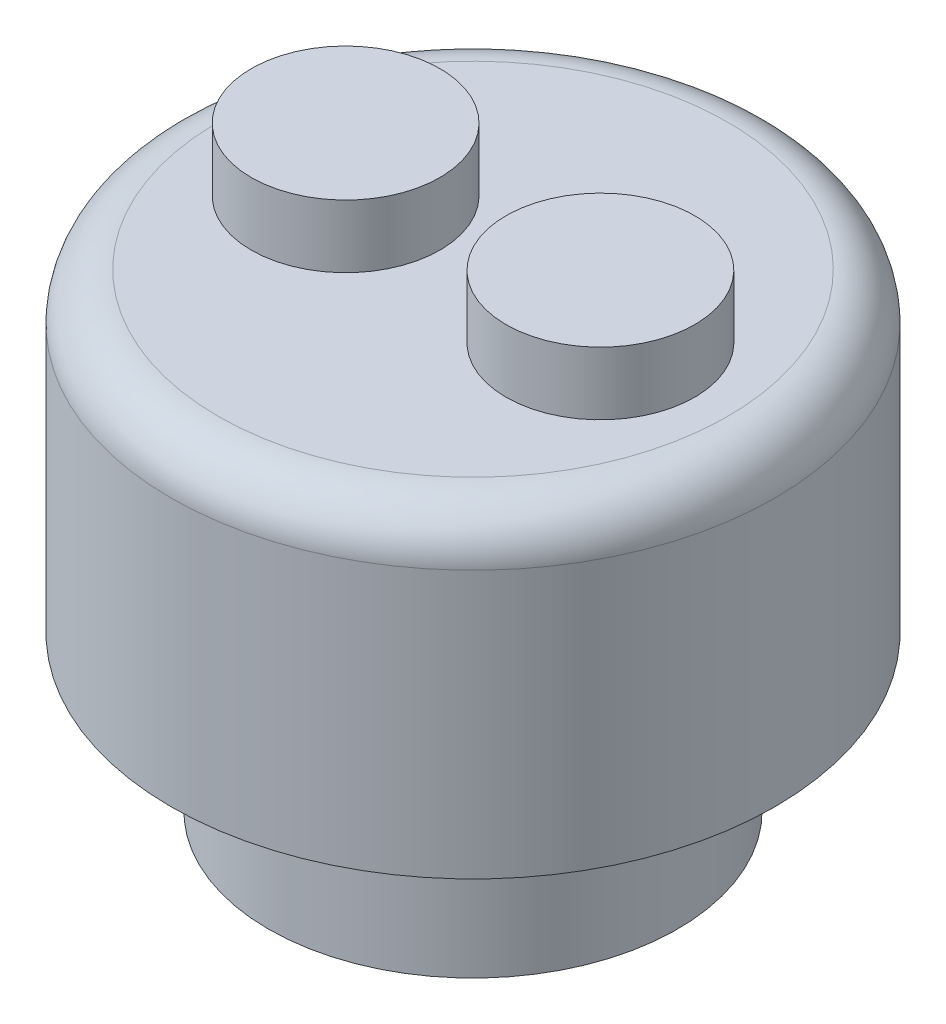
ISO-10303-21;
HEADER;
FILE_DESCRIPTION(('STEP AP214'),'2;1');
FILE_NAME('part.step','',(''),(''),'','','');
FILE_SCHEMA(('AUTOMOTIVE_DESIGN { 1 0 10303 214 1 1 1 1 }'));
ENDSEC;
DATA;
#1=APPLICATION_CONTEXT('core data for automotive mechanical design processes');
#2=APPLICATION_PROTOCOL_DEFINITION('international standard','automotive_design',2000,#1);
#3=PRODUCT_CONTEXT('',#1,'mechanical');
#4=PRODUCT('Part','Part','',(#3));
#5=PRODUCT_RELATED_PRODUCT_CATEGORY('part','',(#4));
#6=PRODUCT_DEFINITION_FORMATION('','',#4);
#7=PRODUCT_DEFINITION_CONTEXT('part definition',#1,'design');
#8=PRODUCT_DEFINITION('design','',#6,#7);
#9=PRODUCT_DEFINITION_SHAPE('','',#8);
#10=(LENGTH_UNIT() NAMED_UNIT(*) SI_UNIT(.MILLI.,.METRE.));
#11=(NAMED_UNIT(*) PLANE_ANGLE_UNIT() SI_UNIT($,.RADIAN.));
#12=(NAMED_UNIT(*) SI_UNIT($,.STERADIAN.) SOLID_ANGLE_UNIT());
#13=UNCERTAINTY_MEASURE_WITH_UNIT(LENGTH_MEASURE(1.E-05),#10,'distance_accuracy_value','');
#14=(GEOMETRIC_REPRESENTATION_CONTEXT(3) GLOBAL_UNCERTAINTY_ASSIGNED_CONTEXT((#13)) GLOBAL_UNIT_ASSIGNED_CONTEXT((#10,
#11,#12)) REPRESENTATION_CONTEXT('',''));
#15=CARTESIAN_POINT('',(0.,0.,0.));
#16=DIRECTION('',(0.,0.,1.));
#17=DIRECTION('',(1.,0.,0.));
#18=AXIS2_PLACEMENT_3D('',#15,#16,#17);
#19=CARTESIAN_POINT('',(0.,2.46,0.));
#20=DIRECTION('',(0.,-1.,0.));
#21=DIRECTION('',(0.,0.,-1.));
#22=AXIS2_PLACEMENT_3D('',#19,#20,#21);
#23=CYLINDRICAL_SURFACE('',#22,3.25);
#24=CARTESIAN_POINT('',(0.,2.46,0.));
#25=DIRECTION('',(0.,1.,0.));
#26=DIRECTION('',(0.,0.,1.));
#27=AXIS2_PLACEMENT_3D('',#24,#25,#26);
#28=CIRCLE('',#27,3.25);
#29=CARTESIAN_POINT('',(0.,2.46,3.25));
#30=VERTEX_POINT('',#29);
#31=EDGE_CURVE('E74',#30,#30,#28,.T.);
#32=ORIENTED_EDGE('',*,*,#31,.F.);
#33=EDGE_LOOP('',(#32));
#34=FACE_BOUND('',#33,.T.);
#35=CARTESIAN_POINT('',(0.,0.,0.));
#36=DIRECTION('',(0.,1.,0.));
#37=DIRECTION('',(0.,0.,1.));
#38=AXIS2_PLACEMENT_3D('',#35,#36,#37);
#39=CIRCLE('',#38,3.25);
#40=CARTESIAN_POINT('',(0.,0.,3.25));
#41=VERTEX_POINT('',#40);
#42=EDGE_CURVE('E79',#41,#41,#39,.T.);
#43=ORIENTED_EDGE('',*,*,#42,.T.);
#44=EDGE_LOOP('',(#43));
#45=FACE_BOUND('',#44,.T.);
#46=ADVANCED_FACE('F61',(#34,#45),#23,.T.);
#47=CARTESIAN_POINT('',(0.,0.,0.));
#48=DIRECTION('',(0.,1.,0.));
#49=DIRECTION('',(0.,0.,1.));
#50=AXIS2_PLACEMENT_3D('',#47,#48,#49);
#51=PLANE('',#50);
#52=CARTESIAN_POINT('',(0.,0.,0.));
#53=DIRECTION('',(0.,-1.,0.));
#54=DIRECTION('',(0.,0.,-1.));
#55=AXIS2_PLACEMENT_3D('',#52,#53,#54);
#56=CIRCLE('',#55,1.75);
#57=CARTESIAN_POINT('',(0.,0.,-1.75));
#58=VERTEX_POINT('',#57);
#59=EDGE_CURVE('E84',#58,#58,#56,.T.);
#60=ORIENTED_EDGE('',*,*,#59,.F.);
#61=EDGE_LOOP('',(#60));
#62=FACE_BOUND('',#61,.T.);
#63=ORIENTED_EDGE('',*,*,#42,.F.);
#64=EDGE_LOOP('',(#63));
#65=FACE_BOUND('',#64,.T.);
#66=ADVANCED_FACE('F139',(#62,#65),#51,.F.);
#67=CARTESIAN_POINT('',(0.,2.5,0.));
#68=DIRECTION('',(0.,-1.,0.));
#69=DIRECTION('',(0.,0.,-1.));
#70=AXIS2_PLACEMENT_3D('',#67,#68,#69);
#71=CYLINDRICAL_SURFACE('',#70,1.75);
#72=CARTESIAN_POINT('',(0.,2.46,0.));
#73=DIRECTION('',(0.,1.,0.));
#74=DIRECTION('',(0.,0.,1.));
#75=AXIS2_PLACEMENT_3D('',#72,#73,#74);
#76=CIRCLE('',#75,1.75);
#77=CARTESIAN_POINT('',(0.,2.46,1.75));
#78=VERTEX_POINT('',#77);
#79=EDGE_CURVE('E86',#78,#78,#76,.T.);
#80=ORIENTED_EDGE('',*,*,#79,.T.);
#81=EDGE_LOOP('',(#80));
#82=FACE_BOUND('',#81,.T.);
#83=ORIENTED_EDGE('',*,*,#59,.T.);
#84=EDGE_LOOP('',(#83));
#85=FACE_BOUND('',#84,.T.);
#86=ADVANCED_FACE('F144',(#82,#85),#71,.F.);
#87=CARTESIAN_POINT('',(0.,2.46,0.));
#88=DIRECTION('',(0.,1.,0.));
#89=DIRECTION('',(0.,0.,1.));
#90=AXIS2_PLACEMENT_3D('',#87,#88,#89);
#91=PLANE('',#90);
#92=ORIENTED_EDGE('',*,*,#31,.T.);
#93=EDGE_LOOP('',(#92));
#94=FACE_BOUND('',#93,.T.);
#95=CARTESIAN_POINT('',(0.,2.46,0.));
#96=DIRECTION('',(0.,1.,0.));
#97=DIRECTION('',(0.,0.,1.));
#98=AXIS2_PLACEMENT_3D('',#95,#96,#97);
#99=CIRCLE('',#98,4.8);
#100=CARTESIAN_POINT('',(0.,2.46,4.8));
#101=VERTEX_POINT('',#100);
#102=EDGE_CURVE('E90',#101,#101,#99,.T.);
#103=ORIENTED_EDGE('',*,*,#102,.F.);
#104=EDGE_LOOP('',(#103));
#105=FACE_BOUND('',#104,.T.);
#106=ADVANCED_FACE('F120',(#94,#105),#91,.F.);
#107=CARTESIAN_POINT('',(0.,7.46,0.));
#108=DIRECTION('',(0.,1.,0.));
#109=DIRECTION('',(0.,0.,1.));
#110=AXIS2_PLACEMENT_3D('',#107,#108,#109);
#111=PLANE('',#110);
#112=CARTESIAN_POINT('',(2.025,7.46,0.));
#113=DIRECTION('',(0.,1.,0.));
#114=DIRECTION('',(0.,0.,1.));
#115=AXIS2_PLACEMENT_3D('',#112,#113,#114);
#116=CIRCLE('',#115,1.5);
#117=CARTESIAN_POINT('',(2.025,7.46,1.5));
#118=VERTEX_POINT('',#117);
#119=EDGE_CURVE('E102',#118,#118,#116,.T.);
#120=ORIENTED_EDGE('',*,*,#119,.F.);
#121=EDGE_LOOP('',(#120));
#122=FACE_BOUND('',#121,.T.);
#123=CARTESIAN_POINT('',(-2.025,7.46,0.));
#124=DIRECTION('',(0.,1.,0.));
#125=DIRECTION('',(0.,0.,1.));
#126=AXIS2_PLACEMENT_3D('',#123,#124,#125);
#127=CIRCLE('',#126,1.5);
#128=CARTESIAN_POINT('',(-2.025,7.46,1.5));
#129=VERTEX_POINT('',#128);
#130=EDGE_CURVE('E98',#129,#129,#127,.T.);
#131=ORIENTED_EDGE('',*,*,#130,.F.);
#132=EDGE_LOOP('',(#131));
#133=FACE_BOUND('',#132,.T.);
#134=CARTESIAN_POINT('',(0.,7.46,0.));
#135=DIRECTION('',(0.,1.,0.));
#136=DIRECTION('',(0.,0.,1.));
#137=AXIS2_PLACEMENT_3D('',#134,#135,#136);
#138=CIRCLE('',#137,4.05);
#139=CARTESIAN_POINT('',(0.,7.46,4.05));
#140=VERTEX_POINT('',#139);
#141=EDGE_CURVE('E69',#140,#140,#138,.T.);
#142=ORIENTED_EDGE('',*,*,#141,.T.);
#143=EDGE_LOOP('',(#142));
#144=FACE_BOUND('',#143,.T.);
#145=ADVANCED_FACE('F116',(#122,#133,#144),#111,.T.);
#146=CARTESIAN_POINT('',(0.,7.46,0.));
#147=DIRECTION('',(0.,-1.,0.));
#148=DIRECTION('',(0.,0.,-1.));
#149=AXIS2_PLACEMENT_3D('',#146,#147,#148);
#150=CYLINDRICAL_SURFACE('',#149,4.8);
#151=CARTESIAN_POINT('',(0.,6.71,0.));
#152=DIRECTION('',(0.,1.,0.));
#153=DIRECTION('',(0.,0.,1.));
#154=AXIS2_PLACEMENT_3D('',#151,#152,#153);
#155=CIRCLE('',#154,4.8);
#156=CARTESIAN_POINT('',(0.,6.71,4.8));
#157=VERTEX_POINT('',#156);
#158=EDGE_CURVE('E11',#157,#157,#155,.F.);
#159=ORIENTED_EDGE('',*,*,#158,.T.);
#160=EDGE_LOOP('',(#159));
#161=FACE_BOUND('',#160,.T.);
#162=ORIENTED_EDGE('',*,*,#102,.T.);
#163=EDGE_LOOP('',(#162));
#164=FACE_BOUND('',#163,.T.);
#165=ADVANCED_FACE('F119',(#161,#164),#150,.T.);
#166=ORIENTED_EDGE('',*,*,#79,.F.);
#167=EDGE_LOOP('',(#166));
#168=FACE_BOUND('',#167,.T.);
#169=ADVANCED_FACE('F135',(#168),#91,.F.);
#170=CARTESIAN_POINT('',(0.,6.71,0.));
#171=DIRECTION('',(0.,1.,0.));
#172=DIRECTION('',(0.,0.,1.));
#173=AXIS2_PLACEMENT_3D('',#170,#171,#172);
#174=TOROIDAL_SURFACE('',#173,4.05,0.75);
#175=ORIENTED_EDGE('',*,*,#158,.F.);
#176=EDGE_LOOP('',(#175));
#177=FACE_BOUND('',#176,.T.);
#178=ORIENTED_EDGE('',*,*,#141,.F.);
#179=EDGE_LOOP('',(#178));
#180=FACE_BOUND('',#179,.T.);
#181=ADVANCED_FACE('F63',(#177,#180),#174,.T.);
#182=CARTESIAN_POINT('',(-2.025,8.46,0.));
#183=DIRECTION('',(0.,-1.,0.));
#184=DIRECTION('',(0.,0.,-1.));
#185=AXIS2_PLACEMENT_3D('',#182,#183,#184);
#186=CYLINDRICAL_SURFACE('',#185,1.5);
#187=CARTESIAN_POINT('',(-2.025,8.46,0.));
#188=DIRECTION('',(0.,1.,0.));
#189=DIRECTION('',(0.,0.,1.));
#190=AXIS2_PLACEMENT_3D('',#187,#188,#189);
#191=CIRCLE('',#190,1.5);
#192=CARTESIAN_POINT('',(-2.025,8.46,1.5));
#193=VERTEX_POINT('',#192);
#194=EDGE_CURVE('E97',#193,#193,#191,.T.);
#195=ORIENTED_EDGE('',*,*,#194,.F.);
#196=EDGE_LOOP('',(#195));
#197=FACE_BOUND('',#196,.T.);
#198=ORIENTED_EDGE('',*,*,#130,.T.);
#199=EDGE_LOOP('',(#198));
#200=FACE_BOUND('',#199,.T.);
#201=ADVANCED_FACE('F124',(#197,#200),#186,.T.);
#202=CARTESIAN_POINT('',(-2.025,8.46,0.));
#203=DIRECTION('',(0.,1.,0.));
#204=DIRECTION('',(0.,0.,1.));
#205=AXIS2_PLACEMENT_3D('',#202,#203,#204);
#206=PLANE('',#205);
#207=ORIENTED_EDGE('',*,*,#194,.T.);
#208=EDGE_LOOP('',(#207));
#209=FACE_BOUND('',#208,.T.);
#210=ADVANCED_FACE('F126',(#209),#206,.T.);
#211=CARTESIAN_POINT('',(2.025,8.46,0.));
#212=DIRECTION('',(0.,-1.,0.));
#213=DIRECTION('',(0.,0.,-1.));
#214=AXIS2_PLACEMENT_3D('',#211,#212,#213);
#215=CYLINDRICAL_SURFACE('',#214,1.5);
#216=CARTESIAN_POINT('',(2.025,8.46,0.));
#217=DIRECTION('',(0.,1.,0.));
#218=DIRECTION('',(0.,0.,1.));
#219=AXIS2_PLACEMENT_3D('',#216,#217,#218);
#220=CIRCLE('',#219,1.5);
#221=CARTESIAN_POINT('',(2.025,8.46,1.5));
#222=VERTEX_POINT('',#221);
#223=EDGE_CURVE('E106',#222,#222,#220,.T.);
#224=ORIENTED_EDGE('',*,*,#223,.F.);
#225=EDGE_LOOP('',(#224));
#226=FACE_BOUND('',#225,.T.);
#227=ORIENTED_EDGE('',*,*,#119,.T.);
#228=EDGE_LOOP('',(#227));
#229=FACE_BOUND('',#228,.T.);
#230=ADVANCED_FACE('F114',(#226,#229),#215,.T.);
#231=CARTESIAN_POINT('',(2.025,8.46,0.));
#232=DIRECTION('',(0.,1.,0.));
#233=DIRECTION('',(0.,0.,1.));
#234=AXIS2_PLACEMENT_3D('',#231,#232,#233);
#235=PLANE('',#234);
#236=ORIENTED_EDGE('',*,*,#223,.T.);
#237=EDGE_LOOP('',(#236));
#238=FACE_BOUND('',#237,.T.);
#239=ADVANCED_FACE('F225',(#238),#235,.T.);
#240=CLOSED_SHELL('',(#46,#66,#86,#106,#145,#165,#169,#181,#201,#210,#230,#239));
#241=MANIFOLD_SOLID_BREP('B2',#240);
#242=ADVANCED_BREP_SHAPE_REPRESENTATION('',(#18,#241),#14);
#243=SHAPE_DEFINITION_REPRESENTATION(#9,#242);
ENDSEC;
END-ISO-10303-21;
